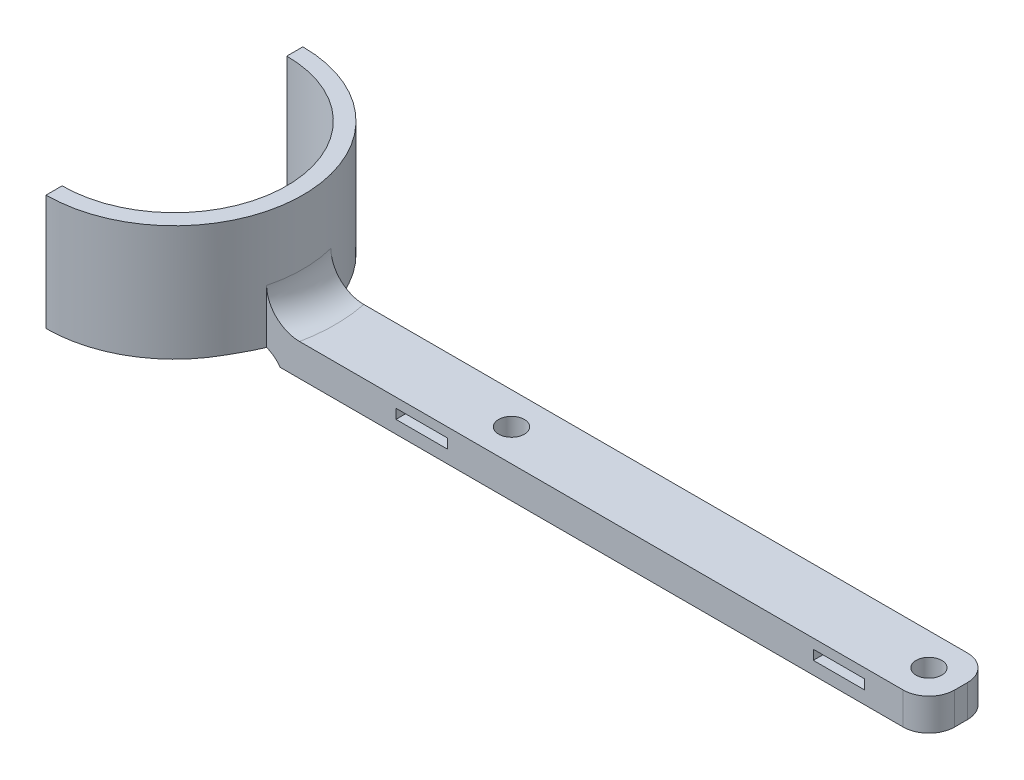
ISO-10303-21;
HEADER;
FILE_DESCRIPTION(('STEP AP214'),'2;1');
FILE_NAME('part.step','',(''),(''),'','','');
FILE_SCHEMA(('AUTOMOTIVE_DESIGN { 1 0 10303 214 1 1 1 1 }'));
ENDSEC;
DATA;
#1=APPLICATION_CONTEXT('core data for automotive mechanical design processes');
#2=APPLICATION_PROTOCOL_DEFINITION('international standard','automotive_design',2000,#1);
#3=PRODUCT_CONTEXT('',#1,'mechanical');
#4=PRODUCT('Part','Part','',(#3));
#5=PRODUCT_RELATED_PRODUCT_CATEGORY('part','',(#4));
#6=PRODUCT_DEFINITION_FORMATION('','',#4);
#7=PRODUCT_DEFINITION_CONTEXT('part definition',#1,'design');
#8=PRODUCT_DEFINITION('design','',#6,#7);
#9=PRODUCT_DEFINITION_SHAPE('','',#8);
#10=(LENGTH_UNIT() NAMED_UNIT(*) SI_UNIT(.MILLI.,.METRE.));
#11=(NAMED_UNIT(*) PLANE_ANGLE_UNIT() SI_UNIT($,.RADIAN.));
#12=(NAMED_UNIT(*) SI_UNIT($,.STERADIAN.) SOLID_ANGLE_UNIT());
#13=UNCERTAINTY_MEASURE_WITH_UNIT(LENGTH_MEASURE(1.E-05),#10,'distance_accuracy_value','');
#14=(GEOMETRIC_REPRESENTATION_CONTEXT(3) GLOBAL_UNCERTAINTY_ASSIGNED_CONTEXT((#13)) GLOBAL_UNIT_ASSIGNED_CONTEXT((#10,
#11,#12)) REPRESENTATION_CONTEXT('',''));
#15=CARTESIAN_POINT('',(0.,0.,0.));
#16=DIRECTION('',(0.,0.,1.));
#17=DIRECTION('',(1.,0.,0.));
#18=AXIS2_PLACEMENT_3D('',#15,#16,#17);
#19=CARTESIAN_POINT('',(0.,2.,0.));
#20=DIRECTION('',(0.,-1.,0.));
#21=DIRECTION('',(0.,0.,-1.));
#22=AXIS2_PLACEMENT_3D('',#19,#20,#21);
#23=PLANE('',#22);
#24=CARTESIAN_POINT('',(-17.5,2.,-5.));
#25=DIRECTION('',(0.,-1.,0.));
#26=DIRECTION('',(0.,0.,-1.));
#27=AXIS2_PLACEMENT_3D('',#24,#25,#26);
#28=CIRCLE('',#27,20.);
#29=CARTESIAN_POINT('',(0.,2.,-14.6824583655185));
#30=VERTEX_POINT('',#29);
#31=CARTESIAN_POINT('',(-17.5,2.,-25.));
#32=VERTEX_POINT('',#31);
#33=EDGE_CURVE('E323',#30,#32,#28,.F.);
#34=ORIENTED_EDGE('',*,*,#33,.F.);
#35=DIRECTION('',(0.,0.,1.));
#36=VECTOR('',#35,1.);
#37=CARTESIAN_POINT('',(0.,2.,0.));
#38=LINE('',#37,#36);
#39=CARTESIAN_POINT('',(0.,2.,-5.));
#40=VERTEX_POINT('',#39);
#41=EDGE_CURVE('E228',#30,#40,#38,.T.);
#42=ORIENTED_EDGE('',*,*,#41,.T.);
#43=CARTESIAN_POINT('',(-17.5,2.,-5.));
#44=DIRECTION('',(0.,-1.,0.));
#45=DIRECTION('',(0.,0.,-1.));
#46=AXIS2_PLACEMENT_3D('',#43,#44,#45);
#47=CIRCLE('',#46,17.5);
#48=CARTESIAN_POINT('',(-17.5,2.,-22.5));
#49=VERTEX_POINT('',#48);
#50=EDGE_CURVE('E207',#40,#49,#47,.F.);
#51=ORIENTED_EDGE('',*,*,#50,.T.);
#52=DIRECTION('',(0.,0.,-1.));
#53=VECTOR('',#52,1.);
#54=CARTESIAN_POINT('',(-17.5,2.,-38.3026296480996));
#55=LINE('',#54,#53);
#56=EDGE_CURVE('E321',#49,#32,#55,.T.);
#57=ORIENTED_EDGE('',*,*,#56,.T.);
#58=EDGE_LOOP('',(#34,#42,#51,#57));
#59=FACE_BOUND('',#58,.T.);
#60=ADVANCED_FACE('F45',(#59),#23,.T.);
#61=CARTESIAN_POINT('',(-17.5,0.,-5.));
#62=DIRECTION('',(0.,1.,0.));
#63=DIRECTION('',(0.,0.,1.));
#64=AXIS2_PLACEMENT_3D('',#61,#62,#63);
#65=CYLINDRICAL_SURFACE('',#64,20.);
#66=DIRECTION('',(0.,1.,0.));
#67=VECTOR('',#66,1.);
#68=CARTESIAN_POINT('',(1.86491673103708,0.,0.));
#69=LINE('',#68,#67);
#70=CARTESIAN_POINT('',(1.86491673103708,10.,0.));
#71=VERTEX_POINT('',#70);
#72=CARTESIAN_POINT('',(1.86491673103708,1.6391901864763,0.));
#73=VERTEX_POINT('',#72);
#74=EDGE_CURVE('E72',#71,#73,#69,.F.);
#75=ORIENTED_EDGE('',*,*,#74,.F.);
#76=CARTESIAN_POINT('',(-17.5,10.,-5.));
#77=DIRECTION('',(0.,-1.,0.));
#78=DIRECTION('',(0.,0.,-1.));
#79=AXIS2_PLACEMENT_3D('',#76,#77,#78);
#80=CIRCLE('',#79,20.);
#81=CARTESIAN_POINT('',(1.86491673103708,10.,-10.));
#82=VERTEX_POINT('',#81);
#83=EDGE_CURVE('E455',#71,#82,#80,.F.);
#84=ORIENTED_EDGE('',*,*,#83,.T.);
#85=DIRECTION('',(0.,1.,0.));
#86=VECTOR('',#85,1.);
#87=CARTESIAN_POINT('',(1.86491673103708,0.,-10.));
#88=LINE('',#87,#86);
#89=CARTESIAN_POINT('',(1.86491673103708,1.6391901864763,-10.));
#90=VERTEX_POINT('',#89);
#91=EDGE_CURVE('E64',#90,#82,#88,.T.);
#92=ORIENTED_EDGE('',*,*,#91,.F.);
#93=CARTESIAN_POINT('',(1.86491673103708,1.6391901864763,-10.));
#94=CARTESIAN_POINT('',(1.81226329074044,1.6603515909012,-10.2039176181783));
#95=CARTESIAN_POINT('',(1.75640467132598,1.68177058884214,-10.4069575920873));
#96=CARTESIAN_POINT('',(1.63829552342442,1.72439816300847,-10.8111972007738));
#97=CARTESIAN_POINT('',(1.57604484519339,1.74560673429152,-11.0123967923172));
#98=CARTESIAN_POINT('',(1.38035329785686,1.80763126287868,-11.6112052217273));
#99=CARTESIAN_POINT('',(1.23747579915219,1.84705921413643,-12.0059480297596));
#100=CARTESIAN_POINT('',(1.00450760610095,1.89870188485478,-12.5912670586032));
#101=CARTESIAN_POINT('',(0.923726300532522,1.91466848018121,-12.785275948779));
#102=CARTESIAN_POINT('',(0.755992419655626,1.94324940450123,-13.1708587526142));
#103=CARTESIAN_POINT('',(0.669040235316233,1.95586394563148,-13.3624328196318));
#104=CARTESIAN_POINT('',(0.488622628244336,1.97690087302719,-13.7438063077981));
#105=CARTESIAN_POINT('',(0.395129240854922,1.98530382628287,-13.9335936084707));
#106=CARTESIAN_POINT('',(0.202079029650203,1.99684735804117,-14.3102755909404));
#107=CARTESIAN_POINT('',(0.102520726105051,1.99998664693274,-14.4971695527531));
#108=CARTESIAN_POINT('',(0.,2.00000000000002,-14.6824583655185));
#109=B_SPLINE_CURVE_WITH_KNOTS('',3,(#93,#94,#95,#96,#97,#98,#99,#100,#101,#102,#103,#104,#105,
#106,#107,#108),.UNSPECIFIED.,.F.,.F.,(4,2,2,2,2,2,2,4),(0.,0.634927689302532,1.26987025617077,
2.53376875469085,3.16595072787684,3.79809268353263,4.43312520218716,5.06831328268851),.UNSPECIFIED.);
#110=EDGE_CURVE('E13',#90,#30,#109,.T.);
#111=ORIENTED_EDGE('',*,*,#110,.T.);
#112=ORIENTED_EDGE('',*,*,#33,.T.);
#113=DIRECTION('',(0.,1.,0.));
#114=VECTOR('',#113,1.);
#115=CARTESIAN_POINT('',(-17.5,0.,-25.));
#116=LINE('',#115,#114);
#117=CARTESIAN_POINT('',(-17.5,20.,-25.));
#118=VERTEX_POINT('',#117);
#119=EDGE_CURVE('E401',#118,#32,#116,.F.);
#120=ORIENTED_EDGE('',*,*,#119,.F.);
#121=CARTESIAN_POINT('',(-17.5,20.,-5.));
#122=DIRECTION('',(0.,1.,0.));
#123=DIRECTION('',(0.,0.,1.));
#124=AXIS2_PLACEMENT_3D('',#121,#122,#123);
#125=CIRCLE('',#124,20.);
#126=CARTESIAN_POINT('',(-17.5,20.,15.));
#127=VERTEX_POINT('',#126);
#128=EDGE_CURVE('E407',#127,#118,#125,.T.);
#129=ORIENTED_EDGE('',*,*,#128,.F.);
#130=DIRECTION('',(0.,1.,0.));
#131=VECTOR('',#130,1.);
#132=CARTESIAN_POINT('',(-17.5,0.,15.));
#133=LINE('',#132,#131);
#134=CARTESIAN_POINT('',(-17.5,2.,15.));
#135=VERTEX_POINT('',#134);
#136=EDGE_CURVE('E394',#135,#127,#133,.T.);
#137=ORIENTED_EDGE('',*,*,#136,.F.);
#138=CARTESIAN_POINT('',(0.,2.,4.68245836551854));
#139=VERTEX_POINT('',#138);
#140=EDGE_CURVE('E319',#135,#139,#28,.F.);
#141=ORIENTED_EDGE('',*,*,#140,.T.);
#142=CARTESIAN_POINT('',(0.,2.,4.68245836551854));
#143=CARTESIAN_POINT('',(0.102520726105052,1.99998664693273,4.49716955275312));
#144=CARTESIAN_POINT('',(0.202079029650203,1.99684735804117,4.31027559094042));
#145=CARTESIAN_POINT('',(0.39512924085492,1.98530382628287,3.93359360847075));
#146=CARTESIAN_POINT('',(0.488622628244331,1.97690087302719,3.7438063077981));
#147=CARTESIAN_POINT('',(0.669040235316227,1.95586394563148,3.36243281963182));
#148=CARTESIAN_POINT('',(0.75599241965562,1.94324940450123,3.17085875261421));
#149=CARTESIAN_POINT('',(0.92372630053252,1.91466848018121,2.78527594877901));
#150=CARTESIAN_POINT('',(1.00450760610095,1.89870188485478,2.59126705860322));
#151=CARTESIAN_POINT('',(1.23747579915219,1.84705921413643,2.00594802975964));
#152=CARTESIAN_POINT('',(1.38035329785685,1.80763126287869,1.61120522172731));
#153=CARTESIAN_POINT('',(1.57604484519338,1.74560673429152,1.0123967923172));
#154=CARTESIAN_POINT('',(1.63829552342441,1.72439816300846,0.811197200773822));
#155=CARTESIAN_POINT('',(1.75640467132598,1.68177058884214,0.406957592087329));
#156=CARTESIAN_POINT('',(1.81226329074045,1.66035159090122,0.203917618178342));
#157=CARTESIAN_POINT('',(1.86491673103708,1.63919018647635,0.));
#158=B_SPLINE_CURVE_WITH_KNOTS('',3,(#142,#143,#144,#145,#146,#147,#148,#149,#150,#151,#152,
#153,#154,#155,#156,#157),.UNSPECIFIED.,.F.,.F.,(4,2,2,2,2,2,2,4),(0.,0.63518808050135,
1.27022059915589,1.90236255481167,2.53454452799766,3.79844302651774,4.43338559338598,
5.06831328268851),.UNSPECIFIED.);
#159=EDGE_CURVE('E221',#139,#73,#158,.T.);
#160=ORIENTED_EDGE('',*,*,#159,.T.);
#161=EDGE_LOOP('',(#75,#84,#92,#111,#112,#120,#129,#137,#141,#160));
#162=FACE_BOUND('',#161,.T.);
#163=ADVANCED_FACE('F230',(#162),#65,.T.);
#164=CARTESIAN_POINT('',(-17.5,0.,-5.));
#165=DIRECTION('',(0.,1.,0.));
#166=DIRECTION('',(0.,0.,1.));
#167=AXIS2_PLACEMENT_3D('',#164,#165,#166);
#168=CYLINDRICAL_SURFACE('',#167,17.5);
#169=CARTESIAN_POINT('',(-17.5,2.,12.5));
#170=VERTEX_POINT('',#169);
#171=EDGE_CURVE('E312',#170,#40,#47,.F.);
#172=ORIENTED_EDGE('',*,*,#171,.F.);
#173=DIRECTION('',(0.,1.,0.));
#174=VECTOR('',#173,1.);
#175=CARTESIAN_POINT('',(-17.5,0.,12.5));
#176=LINE('',#175,#174);
#177=CARTESIAN_POINT('',(-17.5,20.,12.5));
#178=VERTEX_POINT('',#177);
#179=EDGE_CURVE('E396',#170,#178,#176,.T.);
#180=ORIENTED_EDGE('',*,*,#179,.T.);
#181=CARTESIAN_POINT('',(-17.5,20.,-5.));
#182=DIRECTION('',(0.,1.,0.));
#183=DIRECTION('',(0.,0.,1.));
#184=AXIS2_PLACEMENT_3D('',#181,#182,#183);
#185=CIRCLE('',#184,17.5);
#186=CARTESIAN_POINT('',(-17.5,20.,-22.5));
#187=VERTEX_POINT('',#186);
#188=EDGE_CURVE('E404',#178,#187,#185,.T.);
#189=ORIENTED_EDGE('',*,*,#188,.T.);
#190=DIRECTION('',(0.,1.,0.));
#191=VECTOR('',#190,1.);
#192=CARTESIAN_POINT('',(-17.5,0.,-22.5));
#193=LINE('',#192,#191);
#194=EDGE_CURVE('E398',#187,#49,#193,.F.);
#195=ORIENTED_EDGE('',*,*,#194,.T.);
#196=ORIENTED_EDGE('',*,*,#50,.F.);
#197=EDGE_LOOP('',(#172,#180,#189,#195,#196));
#198=FACE_BOUND('',#197,.T.);
#199=ADVANCED_FACE('F235',(#198),#168,.F.);
#200=CARTESIAN_POINT('',(-17.5,0.,-38.3026296480996));
#201=DIRECTION('',(1.,0.,0.));
#202=DIRECTION('',(0.,0.,-1.));
#203=AXIS2_PLACEMENT_3D('',#200,#201,#202);
#204=PLANE('',#203);
#205=ORIENTED_EDGE('',*,*,#56,.F.);
#206=ORIENTED_EDGE('',*,*,#194,.F.);
#207=DIRECTION('',(0.,0.,-1.));
#208=VECTOR('',#207,1.);
#209=CARTESIAN_POINT('',(-17.5,20.,-5.));
#210=LINE('',#209,#208);
#211=EDGE_CURVE('E450',#187,#118,#210,.T.);
#212=ORIENTED_EDGE('',*,*,#211,.T.);
#213=ORIENTED_EDGE('',*,*,#119,.T.);
#214=EDGE_LOOP('',(#205,#206,#212,#213));
#215=FACE_BOUND('',#214,.T.);
#216=ADVANCED_FACE('F480',(#215),#204,.F.);
#217=DIRECTION('',(0.,0.,-1.));
#218=VECTOR('',#217,1.);
#219=CARTESIAN_POINT('',(-17.5,2.,-38.3026296480996));
#220=LINE('',#219,#218);
#221=EDGE_CURVE('E315',#135,#170,#220,.T.);
#222=ORIENTED_EDGE('',*,*,#221,.F.);
#223=ORIENTED_EDGE('',*,*,#136,.T.);
#224=DIRECTION('',(0.,0.,-1.));
#225=VECTOR('',#224,1.);
#226=CARTESIAN_POINT('',(-17.5,20.,-38.3026296480996));
#227=LINE('',#226,#225);
#228=EDGE_CURVE('E391',#127,#178,#227,.T.);
#229=ORIENTED_EDGE('',*,*,#228,.T.);
#230=ORIENTED_EDGE('',*,*,#179,.F.);
#231=EDGE_LOOP('',(#222,#223,#229,#230));
#232=FACE_BOUND('',#231,.T.);
#233=ADVANCED_FACE('F250',(#232),#204,.F.);
#234=CARTESIAN_POINT('',(101.,5.,-6.));
#235=DIRECTION('',(0.,-1.,0.));
#236=DIRECTION('',(0.,0.,-1.));
#237=AXIS2_PLACEMENT_3D('',#234,#235,#236);
#238=PLANE('',#237);
#239=DIRECTION('',(-1.,0.,0.));
#240=VECTOR('',#239,1.);
#241=CARTESIAN_POINT('',(0.,5.,-10.));
#242=LINE('',#241,#240);
#243=CARTESIAN_POINT('',(101.,5.,-10.));
#244=VERTEX_POINT('',#243);
#245=CARTESIAN_POINT('',(6.99489742783178,5.,-10.));
#246=VERTEX_POINT('',#245);
#247=EDGE_CURVE('E430',#244,#246,#242,.T.);
#248=ORIENTED_EDGE('',*,*,#247,.T.);
#249=CARTESIAN_POINT('',(-17.5,5.,-5.));
#250=DIRECTION('',(0.,-1.,0.));
#251=DIRECTION('',(0.,0.,-1.));
#252=AXIS2_PLACEMENT_3D('',#249,#250,#251);
#253=CIRCLE('',#252,25.);
#254=CARTESIAN_POINT('',(6.99489742783178,5.,0.));
#255=VERTEX_POINT('',#254);
#256=EDGE_CURVE('E453',#246,#255,#253,.T.);
#257=ORIENTED_EDGE('',*,*,#256,.T.);
#258=DIRECTION('',(1.,0.,0.));
#259=VECTOR('',#258,1.);
#260=CARTESIAN_POINT('',(0.,5.,0.));
#261=LINE('',#260,#259);
#262=CARTESIAN_POINT('',(101.,5.,0.));
#263=VERTEX_POINT('',#262);
#264=EDGE_CURVE('E216',#255,#263,#261,.T.);
#265=ORIENTED_EDGE('',*,*,#264,.T.);
#266=CARTESIAN_POINT('',(101.,5.,-4.));
#267=DIRECTION('',(0.,1.,0.));
#268=DIRECTION('',(0.,0.,1.));
#269=AXIS2_PLACEMENT_3D('',#266,#267,#268);
#270=CIRCLE('',#269,4.);
#271=CARTESIAN_POINT('',(105.,5.,-4.00000000000003));
#272=VERTEX_POINT('',#271);
#273=EDGE_CURVE('E424',#263,#272,#270,.T.);
#274=ORIENTED_EDGE('',*,*,#273,.T.);
#275=DIRECTION('',(0.,0.,-1.));
#276=VECTOR('',#275,1.);
#277=CARTESIAN_POINT('',(105.,5.,-4.00000000000003));
#278=LINE('',#277,#276);
#279=CARTESIAN_POINT('',(105.,5.,-5.99999999999997));
#280=VERTEX_POINT('',#279);
#281=EDGE_CURVE('E426',#272,#280,#278,.T.);
#282=ORIENTED_EDGE('',*,*,#281,.T.);
#283=CARTESIAN_POINT('',(101.,5.,-6.));
#284=DIRECTION('',(0.,1.,0.));
#285=DIRECTION('',(0.,0.,-1.));
#286=AXIS2_PLACEMENT_3D('',#283,#284,#285);
#287=CIRCLE('',#286,4.);
#288=EDGE_CURVE('E428',#280,#244,#287,.T.);
#289=ORIENTED_EDGE('',*,*,#288,.T.);
#290=EDGE_LOOP('',(#248,#257,#265,#274,#282,#289));
#291=FACE_BOUND('',#290,.T.);
#292=CARTESIAN_POINT('',(35.,5.,-5.));
#293=DIRECTION('',(0.,1.,0.));
#294=DIRECTION('',(0.,0.,1.));
#295=AXIS2_PLACEMENT_3D('',#292,#293,#294);
#296=CIRCLE('',#295,2.);
#297=CARTESIAN_POINT('',(35.,5.,-3.));
#298=VERTEX_POINT('',#297);
#299=EDGE_CURVE('E418',#298,#298,#296,.T.);
#300=ORIENTED_EDGE('',*,*,#299,.F.);
#301=EDGE_LOOP('',(#300));
#302=FACE_BOUND('',#301,.T.);
#303=CARTESIAN_POINT('',(100.,5.,-5.));
#304=DIRECTION('',(0.,1.,0.));
#305=DIRECTION('',(0.,0.,1.));
#306=AXIS2_PLACEMENT_3D('',#303,#304,#305);
#307=CIRCLE('',#306,2.);
#308=CARTESIAN_POINT('',(100.,5.,-3.00000000000001));
#309=VERTEX_POINT('',#308);
#310=EDGE_CURVE('E412',#309,#309,#307,.T.);
#311=ORIENTED_EDGE('',*,*,#310,.F.);
#312=EDGE_LOOP('',(#311));
#313=FACE_BOUND('',#312,.T.);
#314=ADVANCED_FACE('F247',(#291,#302,#313),#238,.F.);
#315=CARTESIAN_POINT('',(101.,0.,-6.));
#316=DIRECTION('',(0.,-1.,0.));
#317=DIRECTION('',(0.,0.,-1.));
#318=AXIS2_PLACEMENT_3D('',#315,#316,#317);
#319=PLANE('',#318);
#320=DIRECTION('',(0.,0.,1.));
#321=VECTOR('',#320,1.);
#322=CARTESIAN_POINT('',(4.,0.,24.2480124044716));
#323=LINE('',#322,#321);
#324=CARTESIAN_POINT('',(4.,0.,-10.));
#325=VERTEX_POINT('',#324);
#326=CARTESIAN_POINT('',(4.,0.,0.));
#327=VERTEX_POINT('',#326);
#328=EDGE_CURVE('E196',#325,#327,#323,.T.);
#329=ORIENTED_EDGE('',*,*,#328,.F.);
#330=DIRECTION('',(-1.,0.,0.));
#331=VECTOR('',#330,1.);
#332=CARTESIAN_POINT('',(0.,0.,-10.));
#333=LINE('',#332,#331);
#334=CARTESIAN_POINT('',(101.,0.,-10.));
#335=VERTEX_POINT('',#334);
#336=EDGE_CURVE('E201',#335,#325,#333,.T.);
#337=ORIENTED_EDGE('',*,*,#336,.F.);
#338=CARTESIAN_POINT('',(101.,0.,-6.));
#339=DIRECTION('',(0.,1.,0.));
#340=DIRECTION('',(0.,0.,-1.));
#341=AXIS2_PLACEMENT_3D('',#338,#339,#340);
#342=CIRCLE('',#341,4.);
#343=CARTESIAN_POINT('',(105.,0.,-5.99999999999997));
#344=VERTEX_POINT('',#343);
#345=EDGE_CURVE('E217',#344,#335,#342,.T.);
#346=ORIENTED_EDGE('',*,*,#345,.F.);
#347=DIRECTION('',(0.,0.,-1.));
#348=VECTOR('',#347,1.);
#349=CARTESIAN_POINT('',(105.,0.,-4.00000000000003));
#350=LINE('',#349,#348);
#351=CARTESIAN_POINT('',(105.,0.,-4.00000000000003));
#352=VERTEX_POINT('',#351);
#353=EDGE_CURVE('E436',#352,#344,#350,.T.);
#354=ORIENTED_EDGE('',*,*,#353,.F.);
#355=CARTESIAN_POINT('',(101.,0.,-4.));
#356=DIRECTION('',(0.,1.,0.));
#357=DIRECTION('',(0.,0.,1.));
#358=AXIS2_PLACEMENT_3D('',#355,#356,#357);
#359=CIRCLE('',#358,4.);
#360=CARTESIAN_POINT('',(101.,0.,0.));
#361=VERTEX_POINT('',#360);
#362=EDGE_CURVE('E434',#361,#352,#359,.T.);
#363=ORIENTED_EDGE('',*,*,#362,.F.);
#364=DIRECTION('',(1.,0.,0.));
#365=VECTOR('',#364,1.);
#366=CARTESIAN_POINT('',(0.,0.,0.));
#367=LINE('',#366,#365);
#368=EDGE_CURVE('E203',#327,#361,#367,.T.);
#369=ORIENTED_EDGE('',*,*,#368,.F.);
#370=EDGE_LOOP('',(#329,#337,#346,#354,#363,#369));
#371=FACE_BOUND('',#370,.T.);
#372=CARTESIAN_POINT('',(35.,0.,-5.));
#373=DIRECTION('',(0.,1.,0.));
#374=DIRECTION('',(0.,0.,1.));
#375=AXIS2_PLACEMENT_3D('',#372,#373,#374);
#376=CIRCLE('',#375,2.);
#377=CARTESIAN_POINT('',(35.,0.,-3.));
#378=VERTEX_POINT('',#377);
#379=EDGE_CURVE('E415',#378,#378,#376,.T.);
#380=ORIENTED_EDGE('',*,*,#379,.T.);
#381=EDGE_LOOP('',(#380));
#382=FACE_BOUND('',#381,.T.);
#383=CARTESIAN_POINT('',(100.,0.,-5.));
#384=DIRECTION('',(0.,1.,0.));
#385=DIRECTION('',(0.,0.,1.));
#386=AXIS2_PLACEMENT_3D('',#383,#384,#385);
#387=CIRCLE('',#386,2.);
#388=CARTESIAN_POINT('',(100.,0.,-3.00000000000001));
#389=VERTEX_POINT('',#388);
#390=EDGE_CURVE('E411',#389,#389,#387,.T.);
#391=ORIENTED_EDGE('',*,*,#390,.T.);
#392=EDGE_LOOP('',(#391));
#393=FACE_BOUND('',#392,.T.);
#394=ADVANCED_FACE('F198',(#371,#382,#393),#319,.T.);
#395=CARTESIAN_POINT('',(0.,5.,0.));
#396=DIRECTION('',(0.,0.,-1.));
#397=DIRECTION('',(-1.,0.,0.));
#398=AXIS2_PLACEMENT_3D('',#395,#396,#397);
#399=PLANE('',#398);
#400=DIRECTION('',(1.,0.,0.));
#401=VECTOR('',#400,1.);
#402=CARTESIAN_POINT('',(0.,3.50000000000004,0.));
#403=LINE('',#402,#401);
#404=CARTESIAN_POINT('',(22.,3.50000000000004,0.));
#405=VERTEX_POINT('',#404);
#406=CARTESIAN_POINT('',(30.,3.50000000000004,0.));
#407=VERTEX_POINT('',#406);
#408=EDGE_CURVE('E353',#405,#407,#403,.T.);
#409=ORIENTED_EDGE('',*,*,#408,.T.);
#410=DIRECTION('',(0.,-1.,0.));
#411=VECTOR('',#410,1.);
#412=CARTESIAN_POINT('',(30.,5.,0.));
#413=LINE('',#412,#411);
#414=CARTESIAN_POINT('',(30.,2.,0.));
#415=VERTEX_POINT('',#414);
#416=EDGE_CURVE('E356',#407,#415,#413,.T.);
#417=ORIENTED_EDGE('',*,*,#416,.T.);
#418=DIRECTION('',(-1.,0.,0.));
#419=VECTOR('',#418,1.);
#420=CARTESIAN_POINT('',(0.,2.,0.));
#421=LINE('',#420,#419);
#422=CARTESIAN_POINT('',(22.,2.,0.));
#423=VERTEX_POINT('',#422);
#424=EDGE_CURVE('E341',#415,#423,#421,.T.);
#425=ORIENTED_EDGE('',*,*,#424,.T.);
#426=DIRECTION('',(0.,1.,0.));
#427=VECTOR('',#426,1.);
#428=CARTESIAN_POINT('',(22.,5.,0.));
#429=LINE('',#428,#427);
#430=EDGE_CURVE('E350',#423,#405,#429,.T.);
#431=ORIENTED_EDGE('',*,*,#430,.T.);
#432=EDGE_LOOP('',(#409,#417,#425,#431));
#433=FACE_BOUND('',#432,.T.);
#434=DIRECTION('',(1.,0.,0.));
#435=VECTOR('',#434,1.);
#436=CARTESIAN_POINT('',(0.,3.5,0.));
#437=LINE('',#436,#435);
#438=CARTESIAN_POINT('',(87.,3.5,0.));
#439=VERTEX_POINT('',#438);
#440=CARTESIAN_POINT('',(95.,3.5,0.));
#441=VERTEX_POINT('',#440);
#442=EDGE_CURVE('E385',#439,#441,#437,.T.);
#443=ORIENTED_EDGE('',*,*,#442,.T.);
#444=DIRECTION('',(0.,-1.,0.));
#445=VECTOR('',#444,1.);
#446=CARTESIAN_POINT('',(95.,5.,0.));
#447=LINE('',#446,#445);
#448=CARTESIAN_POINT('',(95.,2.,0.));
#449=VERTEX_POINT('',#448);
#450=EDGE_CURVE('E388',#441,#449,#447,.T.);
#451=ORIENTED_EDGE('',*,*,#450,.T.);
#452=DIRECTION('',(-1.,0.,0.));
#453=VECTOR('',#452,1.);
#454=CARTESIAN_POINT('',(0.,2.,0.));
#455=LINE('',#454,#453);
#456=CARTESIAN_POINT('',(87.,2.,0.));
#457=VERTEX_POINT('',#456);
#458=EDGE_CURVE('E373',#449,#457,#455,.T.);
#459=ORIENTED_EDGE('',*,*,#458,.T.);
#460=DIRECTION('',(0.,1.,0.));
#461=VECTOR('',#460,1.);
#462=CARTESIAN_POINT('',(87.,5.,0.));
#463=LINE('',#462,#461);
#464=EDGE_CURVE('E382',#457,#439,#463,.T.);
#465=ORIENTED_EDGE('',*,*,#464,.T.);
#466=EDGE_LOOP('',(#443,#451,#459,#465));
#467=FACE_BOUND('',#466,.T.);
#468=ORIENTED_EDGE('',*,*,#74,.T.);
#469=CARTESIAN_POINT('',(0.,-3.,0.));
#470=DIRECTION('',(0.,0.,-1.));
#471=DIRECTION('',(-1.,0.,0.));
#472=AXIS2_PLACEMENT_3D('',#469,#470,#471);
#473=CIRCLE('',#472,5.);
#474=EDGE_CURVE('E220',#73,#327,#473,.T.);
#475=ORIENTED_EDGE('',*,*,#474,.T.);
#476=ORIENTED_EDGE('',*,*,#368,.T.);
#477=DIRECTION('',(0.,-1.,0.));
#478=VECTOR('',#477,1.);
#479=CARTESIAN_POINT('',(101.,5.,0.));
#480=LINE('',#479,#478);
#481=EDGE_CURVE('E446',#263,#361,#480,.T.);
#482=ORIENTED_EDGE('',*,*,#481,.F.);
#483=ORIENTED_EDGE('',*,*,#264,.F.);
#484=CARTESIAN_POINT('',(6.99489742783178,5.,0.));
#485=CARTESIAN_POINT('',(6.84827256867681,4.99998623935014,0.));
#486=CARTESIAN_POINT('',(6.70165140691649,5.00619109058516,0.));
#487=CARTESIAN_POINT('',(6.40945713754822,5.03091099033612,0.));
#488=CARTESIAN_POINT('',(6.26388397940086,5.0494254411538,0.));
#489=CARTESIAN_POINT('',(5.97486426860015,5.09862862799136,0.));
#490=CARTESIAN_POINT('',(5.83141696507336,5.12931295377783,0.));
#491=CARTESIAN_POINT('',(5.54761157658349,5.20263474802971,0.));
#492=CARTESIAN_POINT('',(5.40725346667197,5.24527211992365,0.));
#493=CARTESIAN_POINT('',(5.13058194086134,5.34222714000089,0.));
#494=CARTESIAN_POINT('',(4.99426978287718,5.39654837837592,0.));
#495=CARTESIAN_POINT('',(4.72666627879046,5.51652450037217,0.));
#496=CARTESIAN_POINT('',(4.59537680449572,5.58218355996417,0.));
#497=CARTESIAN_POINT('',(4.33890462965748,5.7243484291116,0.));
#498=CARTESIAN_POINT('',(4.21371848555868,5.80084802487772,0.));
#499=CARTESIAN_POINT('',(3.97026319360027,5.96424702532644,0.));
#500=CARTESIAN_POINT('',(3.85199642926891,6.05114998263272,0.));
#501=CARTESIAN_POINT('',(3.62395626369608,6.23425532972916,0.));
#502=CARTESIAN_POINT('',(3.5141399646676,6.33040428310017,0.));
#503=CARTESIAN_POINT('',(3.30314668565956,6.5317542565203,0.));
#504=CARTESIAN_POINT('',(3.2019695015296,6.63695506254763,0.));
#505=CARTESIAN_POINT('',(3.00903207886966,6.85573381499518,0.));
#506=CARTESIAN_POINT('',(2.91727520237373,6.96931472752614,0.));
#507=CARTESIAN_POINT('',(2.74401910141099,7.20398302317907,0.));
#508=CARTESIAN_POINT('',(2.66251584806303,7.32506742991892,0.));
#509=CARTESIAN_POINT('',(2.5121063951505,7.57117164549936,0.));
#510=CARTESIAN_POINT('',(2.4429623477526,7.69604610586683,0.));
#511=CARTESIAN_POINT('',(2.31573806603581,7.95124832006536,0.));
#512=CARTESIAN_POINT('',(2.25765327961001,8.0815738031398,0.));
#513=CARTESIAN_POINT('',(2.15306231512045,8.34669598892259,0.));
#514=CARTESIAN_POINT('',(2.10654859158839,8.48148971255752,0.));
#515=CARTESIAN_POINT('',(2.02548534088789,8.75457659938317,0.));
#516=CARTESIAN_POINT('',(1.99093190999499,8.89286860492424,0.));
#517=CARTESIAN_POINT('',(1.93009988019848,9.19161115453168,0.));
#518=CARTESIAN_POINT('',(1.90566978636384,9.3524415228554,0.));
#519=CARTESIAN_POINT('',(1.87307015454859,9.67551710269234,0.));
#520=CARTESIAN_POINT('',(1.86487835614016,9.83776007064784,0.));
#521=CARTESIAN_POINT('',(1.86491673103708,10.,0.));
#522=B_SPLINE_CURVE_WITH_KNOTS('',3,(#484,#485,#486,#487,#488,#489,#490,#491,#492,#493,#494,
#495,#496,#497,#498,#499,#500,#501,#502,#503,#504,#505,#506,#507,#508,#509,#510,#511,#512,#513,
#514,#515,#516,#517,#518,#519,#520,#521),.UNSPECIFIED.,.F.,.F.,(4,2,2,2,2,2,2,2,2,2,2,2,2,2,2,2,
2,2,4),(0.,0.439738191525465,0.879455032920368,1.31901267098788,1.75856675786807,
2.19825610337059,2.6381077429907,3.07770827212663,3.51745935012646,3.95480634938013,
4.39214301085202,4.82963521570538,5.26695497946584,5.69464593110612,6.12216045831283,
6.54939546898583,6.97649090248015,7.46368339888763,7.95020755949211),.UNSPECIFIED.);
#523=EDGE_CURVE('E268',#255,#71,#522,.T.);
#524=ORIENTED_EDGE('',*,*,#523,.T.);
#525=EDGE_LOOP('',(#468,#475,#476,#482,#483,#524));
#526=FACE_BOUND('',#525,.T.);
#527=ADVANCED_FACE('F254',(#433,#467,#526),#399,.F.);
#528=CARTESIAN_POINT('',(101.,5.,-4.));
#529=DIRECTION('',(0.,-1.,0.));
#530=DIRECTION('',(0.,0.,-1.));
#531=AXIS2_PLACEMENT_3D('',#528,#529,#530);
#532=CYLINDRICAL_SURFACE('',#531,4.);
#533=ORIENTED_EDGE('',*,*,#362,.T.);
#534=DIRECTION('',(0.,-1.,0.));
#535=VECTOR('',#534,1.);
#536=CARTESIAN_POINT('',(105.,5.,-4.00000000000003));
#537=LINE('',#536,#535);
#538=EDGE_CURVE('E443',#272,#352,#537,.T.);
#539=ORIENTED_EDGE('',*,*,#538,.F.);
#540=ORIENTED_EDGE('',*,*,#273,.F.);
#541=ORIENTED_EDGE('',*,*,#481,.T.);
#542=EDGE_LOOP('',(#533,#539,#540,#541));
#543=FACE_BOUND('',#542,.T.);
#544=ADVANCED_FACE('F283',(#543),#532,.T.);
#545=CARTESIAN_POINT('',(105.,5.,-4.00000000000003));
#546=DIRECTION('',(-1.,0.,0.));
#547=DIRECTION('',(0.,0.,1.));
#548=AXIS2_PLACEMENT_3D('',#545,#546,#547);
#549=PLANE('',#548);
#550=ORIENTED_EDGE('',*,*,#353,.T.);
#551=DIRECTION('',(0.,-1.,0.));
#552=VECTOR('',#551,1.);
#553=CARTESIAN_POINT('',(105.,5.,-5.99999999999997));
#554=LINE('',#553,#552);
#555=EDGE_CURVE('E440',#280,#344,#554,.T.);
#556=ORIENTED_EDGE('',*,*,#555,.F.);
#557=ORIENTED_EDGE('',*,*,#281,.F.);
#558=ORIENTED_EDGE('',*,*,#538,.T.);
#559=EDGE_LOOP('',(#550,#556,#557,#558));
#560=FACE_BOUND('',#559,.T.);
#561=ADVANCED_FACE('F286',(#560),#549,.F.);
#562=CARTESIAN_POINT('',(101.,5.,-6.));
#563=DIRECTION('',(0.,-1.,0.));
#564=DIRECTION('',(0.,0.,-1.));
#565=AXIS2_PLACEMENT_3D('',#562,#563,#564);
#566=CYLINDRICAL_SURFACE('',#565,4.);
#567=ORIENTED_EDGE('',*,*,#345,.T.);
#568=DIRECTION('',(0.,-1.,0.));
#569=VECTOR('',#568,1.);
#570=CARTESIAN_POINT('',(101.,5.,-10.));
#571=LINE('',#570,#569);
#572=EDGE_CURVE('E215',#244,#335,#571,.T.);
#573=ORIENTED_EDGE('',*,*,#572,.F.);
#574=ORIENTED_EDGE('',*,*,#288,.F.);
#575=ORIENTED_EDGE('',*,*,#555,.T.);
#576=EDGE_LOOP('',(#567,#573,#574,#575));
#577=FACE_BOUND('',#576,.T.);
#578=ADVANCED_FACE('F258',(#577),#566,.T.);
#579=CARTESIAN_POINT('',(0.,5.,-10.));
#580=DIRECTION('',(0.,0.,1.));
#581=DIRECTION('',(1.,0.,0.));
#582=AXIS2_PLACEMENT_3D('',#579,#580,#581);
#583=PLANE('',#582);
#584=DIRECTION('',(-1.,0.,0.));
#585=VECTOR('',#584,1.);
#586=CARTESIAN_POINT('',(30.,2.,-10.));
#587=LINE('',#586,#585);
#588=CARTESIAN_POINT('',(30.,2.,-10.));
#589=VERTEX_POINT('',#588);
#590=CARTESIAN_POINT('',(22.,2.,-10.));
#591=VERTEX_POINT('',#590);
#592=EDGE_CURVE('E329',#589,#591,#587,.T.);
#593=ORIENTED_EDGE('',*,*,#592,.F.);
#594=DIRECTION('',(0.,-1.,0.));
#595=VECTOR('',#594,1.);
#596=CARTESIAN_POINT('',(30.,3.50000000000004,-10.));
#597=LINE('',#596,#595);
#598=CARTESIAN_POINT('',(30.,3.50000000000004,-10.));
#599=VERTEX_POINT('',#598);
#600=EDGE_CURVE('E327',#599,#589,#597,.T.);
#601=ORIENTED_EDGE('',*,*,#600,.F.);
#602=DIRECTION('',(1.,0.,0.));
#603=VECTOR('',#602,1.);
#604=CARTESIAN_POINT('',(30.,3.50000000000004,-10.));
#605=LINE('',#604,#603);
#606=CARTESIAN_POINT('',(22.,3.50000000000004,-10.));
#607=VERTEX_POINT('',#606);
#608=EDGE_CURVE('E335',#607,#599,#605,.T.);
#609=ORIENTED_EDGE('',*,*,#608,.F.);
#610=DIRECTION('',(0.,1.,0.));
#611=VECTOR('',#610,1.);
#612=CARTESIAN_POINT('',(22.,3.50000000000004,-10.));
#613=LINE('',#612,#611);
#614=EDGE_CURVE('E332',#591,#607,#613,.T.);
#615=ORIENTED_EDGE('',*,*,#614,.F.);
#616=EDGE_LOOP('',(#593,#601,#609,#615));
#617=FACE_BOUND('',#616,.T.);
#618=DIRECTION('',(-1.,0.,0.));
#619=VECTOR('',#618,1.);
#620=CARTESIAN_POINT('',(95.,2.,-10.));
#621=LINE('',#620,#619);
#622=CARTESIAN_POINT('',(95.,2.,-10.));
#623=VERTEX_POINT('',#622);
#624=CARTESIAN_POINT('',(87.,2.,-10.));
#625=VERTEX_POINT('',#624);
#626=EDGE_CURVE('E361',#623,#625,#621,.T.);
#627=ORIENTED_EDGE('',*,*,#626,.F.);
#628=DIRECTION('',(0.,-1.,0.));
#629=VECTOR('',#628,1.);
#630=CARTESIAN_POINT('',(95.,3.5,-10.));
#631=LINE('',#630,#629);
#632=CARTESIAN_POINT('',(95.,3.5,-10.));
#633=VERTEX_POINT('',#632);
#634=EDGE_CURVE('E359',#633,#623,#631,.T.);
#635=ORIENTED_EDGE('',*,*,#634,.F.);
#636=DIRECTION('',(1.,0.,0.));
#637=VECTOR('',#636,1.);
#638=CARTESIAN_POINT('',(95.,3.5,-10.));
#639=LINE('',#638,#637);
#640=CARTESIAN_POINT('',(87.,3.5,-10.));
#641=VERTEX_POINT('',#640);
#642=EDGE_CURVE('E367',#641,#633,#639,.T.);
#643=ORIENTED_EDGE('',*,*,#642,.F.);
#644=DIRECTION('',(0.,1.,0.));
#645=VECTOR('',#644,1.);
#646=CARTESIAN_POINT('',(87.,3.5,-10.));
#647=LINE('',#646,#645);
#648=EDGE_CURVE('E364',#625,#641,#647,.T.);
#649=ORIENTED_EDGE('',*,*,#648,.F.);
#650=EDGE_LOOP('',(#627,#635,#643,#649));
#651=FACE_BOUND('',#650,.T.);
#652=ORIENTED_EDGE('',*,*,#336,.T.);
#653=CARTESIAN_POINT('',(0.,-3.,-10.));
#654=DIRECTION('',(0.,0.,1.));
#655=DIRECTION('',(1.,0.,0.));
#656=AXIS2_PLACEMENT_3D('',#653,#654,#655);
#657=CIRCLE('',#656,5.);
#658=EDGE_CURVE('E58',#325,#90,#657,.T.);
#659=ORIENTED_EDGE('',*,*,#658,.T.);
#660=ORIENTED_EDGE('',*,*,#91,.T.);
#661=CARTESIAN_POINT('',(1.86491673103708,10.,-10.));
#662=CARTESIAN_POINT('',(1.86489808278,9.86237333544804,-10.));
#663=CARTESIAN_POINT('',(1.87078461128807,9.72475091274214,-10.));
#664=CARTESIAN_POINT('',(1.89423194438067,9.45052097199509,-10.));
#665=CARTESIAN_POINT('',(1.91179127607382,9.31391332810644,-10.));
#666=CARTESIAN_POINT('',(1.95840752093667,9.04292062848671,-10.));
#667=CARTESIAN_POINT('',(1.98744433104574,8.90853211238053,-10.));
#668=CARTESIAN_POINT('',(2.05675636329064,8.64268634509948,-10.));
#669=CARTESIAN_POINT('',(2.09703162436861,8.51122910408341,-10.));
#670=CARTESIAN_POINT('',(2.18847230717807,8.25217621899574,-10.));
#671=CARTESIAN_POINT('',(2.23963656275552,8.12458016308153,-10.));
#672=CARTESIAN_POINT('',(2.3524516467423,7.87405696630322,-10.));
#673=CARTESIAN_POINT('',(2.41410634760383,7.75113157014329,-10.));
#674=CARTESIAN_POINT('',(2.54737260147795,7.51084765295241,-10.));
#675=CARTESIAN_POINT('',(2.61898148011389,7.39348764799534,-10.));
#676=CARTESIAN_POINT('',(2.77163633988652,7.16501460284047,-10.));
#677=CARTESIAN_POINT('',(2.85268585114073,7.05390392261838,-10.));
#678=CARTESIAN_POINT('',(3.02488905876839,6.83703753536162,-10.));
#679=CARTESIAN_POINT('',(3.11617764642605,6.73138893305287,-10.));
#680=CARTESIAN_POINT('',(3.30717300535191,6.52793050351375,-10.));
#681=CARTESIAN_POINT('',(3.40688287517282,6.43012358760667,-10.));
#682=CARTESIAN_POINT('',(3.61396319430983,6.24300326127382,-10.));
#683=CARTESIAN_POINT('',(3.7213326671085,6.1536887715295,-10.));
#684=CARTESIAN_POINT('',(3.94298372185358,5.98406843441632,-10.));
#685=CARTESIAN_POINT('',(4.05726780329284,5.90376587498813,-10.));
#686=CARTESIAN_POINT('',(4.4159635892433,5.67288183393806,-10.));
#687=CARTESIAN_POINT('',(4.6704406662506,5.53755112876395,-10.));
#688=CARTESIAN_POINT('',(5.19803867654763,5.31073869844372,-10.));
#689=CARTESIAN_POINT('',(5.47115340726935,5.2192424658061,-10.));
#690=CARTESIAN_POINT('',(5.95345640203982,5.1007445109237,-10.));
#691=CARTESIAN_POINT('',(6.16006724211789,5.06301254212713,-10.));
#692=CARTESIAN_POINT('',(6.57606104565099,5.01263508337683,-10.));
#693=CARTESIAN_POINT('',(6.78544022589839,4.99995833057963,-10.));
#694=CARTESIAN_POINT('',(6.99489742783178,5.,-10.));
#695=B_SPLINE_CURVE_WITH_KNOTS('',3,(#661,#662,#663,#664,#665,#666,#667,#668,#669,#670,#671,
#672,#673,#674,#675,#676,#677,#678,#679,#680,#681,#682,#683,#684,#685,#686,#687,#688,#689,#690,
#691,#692,#693,#694),.UNSPECIFIED.,.F.,.F.,(4,2,2,2,2,2,2,2,2,2,2,2,2,2,2,2,4),(0.,
0.412747790058947,0.825443508881344,1.23741956237656,1.6493970434199,2.06133042602332,
2.47341620129493,2.88539147520933,3.29752129579023,3.71591728865574,4.13446790376807,
4.55296525318861,4.97161479548013,5.83200834293627,6.69211693681444,7.32074458084533,
7.94858735334463),.UNSPECIFIED.);
#696=EDGE_CURVE('E262',#82,#246,#695,.T.);
#697=ORIENTED_EDGE('',*,*,#696,.T.);
#698=ORIENTED_EDGE('',*,*,#247,.F.);
#699=ORIENTED_EDGE('',*,*,#572,.T.);
#700=EDGE_LOOP('',(#652,#659,#660,#697,#698,#699));
#701=FACE_BOUND('',#700,.T.);
#702=ADVANCED_FACE('F211',(#617,#651,#701),#583,.F.);
#703=CARTESIAN_POINT('',(35.,5.,-5.));
#704=DIRECTION('',(0.,-1.,0.));
#705=DIRECTION('',(0.,0.,-1.));
#706=AXIS2_PLACEMENT_3D('',#703,#704,#705);
#707=CYLINDRICAL_SURFACE('',#706,2.);
#708=ORIENTED_EDGE('',*,*,#299,.T.);
#709=EDGE_LOOP('',(#708));
#710=FACE_BOUND('',#709,.T.);
#711=ORIENTED_EDGE('',*,*,#379,.F.);
#712=EDGE_LOOP('',(#711));
#713=FACE_BOUND('',#712,.T.);
#714=ADVANCED_FACE('F242',(#710,#713),#707,.F.);
#715=CARTESIAN_POINT('',(100.,5.,-5.));
#716=DIRECTION('',(0.,-1.,0.));
#717=DIRECTION('',(0.,0.,-1.));
#718=AXIS2_PLACEMENT_3D('',#715,#716,#717);
#719=CYLINDRICAL_SURFACE('',#718,2.);
#720=ORIENTED_EDGE('',*,*,#310,.T.);
#721=EDGE_LOOP('',(#720));
#722=FACE_BOUND('',#721,.T.);
#723=ORIENTED_EDGE('',*,*,#390,.F.);
#724=EDGE_LOOP('',(#723));
#725=FACE_BOUND('',#724,.T.);
#726=ADVANCED_FACE('F237',(#722,#725),#719,.F.);
#727=CARTESIAN_POINT('',(-17.5,20.,-5.));
#728=DIRECTION('',(0.,1.,0.));
#729=DIRECTION('',(0.,0.,1.));
#730=AXIS2_PLACEMENT_3D('',#727,#728,#729);
#731=PLANE('',#730);
#732=ORIENTED_EDGE('',*,*,#228,.F.);
#733=ORIENTED_EDGE('',*,*,#128,.T.);
#734=ORIENTED_EDGE('',*,*,#211,.F.);
#735=ORIENTED_EDGE('',*,*,#188,.F.);
#736=EDGE_LOOP('',(#732,#733,#734,#735));
#737=FACE_BOUND('',#736,.T.);
#738=ADVANCED_FACE('F241',(#737),#731,.T.);
#739=CARTESIAN_POINT('',(95.,3.5,10.));
#740=DIRECTION('',(1.,0.,0.));
#741=DIRECTION('',(0.,0.,-1.));
#742=AXIS2_PLACEMENT_3D('',#739,#740,#741);
#743=PLANE('',#742);
#744=DIRECTION('',(0.,0.,-1.));
#745=VECTOR('',#744,1.);
#746=CARTESIAN_POINT('',(95.,3.5,10.));
#747=LINE('',#746,#745);
#748=EDGE_CURVE('E371',#441,#633,#747,.T.);
#749=ORIENTED_EDGE('',*,*,#748,.T.);
#750=ORIENTED_EDGE('',*,*,#634,.T.);
#751=DIRECTION('',(0.,0.,-1.));
#752=VECTOR('',#751,1.);
#753=CARTESIAN_POINT('',(95.,2.,10.));
#754=LINE('',#753,#752);
#755=EDGE_CURVE('E370',#449,#623,#754,.T.);
#756=ORIENTED_EDGE('',*,*,#755,.F.);
#757=ORIENTED_EDGE('',*,*,#450,.F.);
#758=EDGE_LOOP('',(#749,#750,#756,#757));
#759=FACE_BOUND('',#758,.T.);
#760=ADVANCED_FACE('F488',(#759),#743,.F.);
#761=CARTESIAN_POINT('',(95.,3.5,10.));
#762=DIRECTION('',(0.,1.,0.));
#763=DIRECTION('',(0.,0.,1.));
#764=AXIS2_PLACEMENT_3D('',#761,#762,#763);
#765=PLANE('',#764);
#766=DIRECTION('',(0.,0.,-1.));
#767=VECTOR('',#766,1.);
#768=CARTESIAN_POINT('',(87.,3.5,10.));
#769=LINE('',#768,#767);
#770=EDGE_CURVE('E374',#439,#641,#769,.T.);
#771=ORIENTED_EDGE('',*,*,#770,.T.);
#772=ORIENTED_EDGE('',*,*,#642,.T.);
#773=ORIENTED_EDGE('',*,*,#748,.F.);
#774=ORIENTED_EDGE('',*,*,#442,.F.);
#775=EDGE_LOOP('',(#771,#772,#773,#774));
#776=FACE_BOUND('',#775,.T.);
#777=ADVANCED_FACE('F494',(#776),#765,.F.);
#778=CARTESIAN_POINT('',(87.,3.5,10.));
#779=DIRECTION('',(-1.,0.,0.));
#780=DIRECTION('',(0.,0.,1.));
#781=AXIS2_PLACEMENT_3D('',#778,#779,#780);
#782=PLANE('',#781);
#783=DIRECTION('',(0.,0.,-1.));
#784=VECTOR('',#783,1.);
#785=CARTESIAN_POINT('',(87.,2.,10.));
#786=LINE('',#785,#784);
#787=EDGE_CURVE('E376',#457,#625,#786,.T.);
#788=ORIENTED_EDGE('',*,*,#787,.T.);
#789=ORIENTED_EDGE('',*,*,#648,.T.);
#790=ORIENTED_EDGE('',*,*,#770,.F.);
#791=ORIENTED_EDGE('',*,*,#464,.F.);
#792=EDGE_LOOP('',(#788,#789,#790,#791));
#793=FACE_BOUND('',#792,.T.);
#794=ADVANCED_FACE('F499',(#793),#782,.F.);
#795=CARTESIAN_POINT('',(95.,2.,10.));
#796=DIRECTION('',(0.,-1.,0.));
#797=DIRECTION('',(0.,0.,-1.));
#798=AXIS2_PLACEMENT_3D('',#795,#796,#797);
#799=PLANE('',#798);
#800=ORIENTED_EDGE('',*,*,#755,.T.);
#801=ORIENTED_EDGE('',*,*,#626,.T.);
#802=ORIENTED_EDGE('',*,*,#787,.F.);
#803=ORIENTED_EDGE('',*,*,#458,.F.);
#804=EDGE_LOOP('',(#800,#801,#802,#803));
#805=FACE_BOUND('',#804,.T.);
#806=ADVANCED_FACE('F511',(#805),#799,.F.);
#807=CARTESIAN_POINT('',(30.,3.50000000000004,10.));
#808=DIRECTION('',(1.,0.,0.));
#809=DIRECTION('',(0.,0.,-1.));
#810=AXIS2_PLACEMENT_3D('',#807,#808,#809);
#811=PLANE('',#810);
#812=DIRECTION('',(0.,0.,-1.));
#813=VECTOR('',#812,1.);
#814=CARTESIAN_POINT('',(30.,3.50000000000004,10.));
#815=LINE('',#814,#813);
#816=EDGE_CURVE('E339',#407,#599,#815,.T.);
#817=ORIENTED_EDGE('',*,*,#816,.T.);
#818=ORIENTED_EDGE('',*,*,#600,.T.);
#819=DIRECTION('',(0.,0.,-1.));
#820=VECTOR('',#819,1.);
#821=CARTESIAN_POINT('',(30.,2.,10.));
#822=LINE('',#821,#820);
#823=EDGE_CURVE('E338',#415,#589,#822,.T.);
#824=ORIENTED_EDGE('',*,*,#823,.F.);
#825=ORIENTED_EDGE('',*,*,#416,.F.);
#826=EDGE_LOOP('',(#817,#818,#824,#825));
#827=FACE_BOUND('',#826,.T.);
#828=ADVANCED_FACE('F520',(#827),#811,.F.);
#829=CARTESIAN_POINT('',(30.,3.50000000000004,10.));
#830=DIRECTION('',(0.,1.,0.));
#831=DIRECTION('',(0.,0.,1.));
#832=AXIS2_PLACEMENT_3D('',#829,#830,#831);
#833=PLANE('',#832);
#834=DIRECTION('',(0.,0.,-1.));
#835=VECTOR('',#834,1.);
#836=CARTESIAN_POINT('',(22.,3.50000000000004,10.));
#837=LINE('',#836,#835);
#838=EDGE_CURVE('E342',#405,#607,#837,.T.);
#839=ORIENTED_EDGE('',*,*,#838,.T.);
#840=ORIENTED_EDGE('',*,*,#608,.T.);
#841=ORIENTED_EDGE('',*,*,#816,.F.);
#842=ORIENTED_EDGE('',*,*,#408,.F.);
#843=EDGE_LOOP('',(#839,#840,#841,#842));
#844=FACE_BOUND('',#843,.T.);
#845=ADVANCED_FACE('F523',(#844),#833,.F.);
#846=CARTESIAN_POINT('',(22.,3.50000000000004,10.));
#847=DIRECTION('',(-1.,0.,0.));
#848=DIRECTION('',(0.,0.,1.));
#849=AXIS2_PLACEMENT_3D('',#846,#847,#848);
#850=PLANE('',#849);
#851=DIRECTION('',(0.,0.,-1.));
#852=VECTOR('',#851,1.);
#853=CARTESIAN_POINT('',(22.,2.,10.));
#854=LINE('',#853,#852);
#855=EDGE_CURVE('E344',#423,#591,#854,.T.);
#856=ORIENTED_EDGE('',*,*,#855,.T.);
#857=ORIENTED_EDGE('',*,*,#614,.T.);
#858=ORIENTED_EDGE('',*,*,#838,.F.);
#859=ORIENTED_EDGE('',*,*,#430,.F.);
#860=EDGE_LOOP('',(#856,#857,#858,#859));
#861=FACE_BOUND('',#860,.T.);
#862=ADVANCED_FACE('F307',(#861),#850,.F.);
#863=CARTESIAN_POINT('',(30.,2.,10.));
#864=DIRECTION('',(0.,-1.,0.));
#865=DIRECTION('',(0.,0.,-1.));
#866=AXIS2_PLACEMENT_3D('',#863,#864,#865);
#867=PLANE('',#866);
#868=ORIENTED_EDGE('',*,*,#823,.T.);
#869=ORIENTED_EDGE('',*,*,#592,.T.);
#870=ORIENTED_EDGE('',*,*,#855,.F.);
#871=ORIENTED_EDGE('',*,*,#424,.F.);
#872=EDGE_LOOP('',(#868,#869,#870,#871));
#873=FACE_BOUND('',#872,.T.);
#874=ADVANCED_FACE('F302',(#873),#867,.F.);
#875=ORIENTED_EDGE('',*,*,#171,.T.);
#876=DIRECTION('',(0.,0.,1.));
#877=VECTOR('',#876,1.);
#878=CARTESIAN_POINT('',(0.,2.,0.));
#879=LINE('',#878,#877);
#880=EDGE_CURVE('E267',#40,#139,#879,.T.);
#881=ORIENTED_EDGE('',*,*,#880,.T.);
#882=ORIENTED_EDGE('',*,*,#140,.F.);
#883=ORIENTED_EDGE('',*,*,#221,.T.);
#884=EDGE_LOOP('',(#875,#881,#882,#883));
#885=FACE_BOUND('',#884,.T.);
#886=ADVANCED_FACE('F277',(#885),#23,.T.);
#887=CARTESIAN_POINT('',(-17.5,10.,-5.));
#888=DIRECTION('',(0.,-1.,0.));
#889=DIRECTION('',(0.,0.,-1.));
#890=AXIS2_PLACEMENT_3D('',#887,#888,#889);
#891=TOROIDAL_SURFACE('',#890,25.,5.);
#892=ORIENTED_EDGE('',*,*,#696,.F.);
#893=ORIENTED_EDGE('',*,*,#83,.F.);
#894=ORIENTED_EDGE('',*,*,#523,.F.);
#895=ORIENTED_EDGE('',*,*,#256,.F.);
#896=EDGE_LOOP('',(#892,#893,#894,#895));
#897=FACE_BOUND('',#896,.T.);
#898=ADVANCED_FACE('F274',(#897),#891,.F.);
#899=CARTESIAN_POINT('',(0.,-3.,24.2480124044716));
#900=DIRECTION('',(0.,0.,-1.));
#901=DIRECTION('',(-1.,0.,0.));
#902=AXIS2_PLACEMENT_3D('',#899,#900,#901);
#903=CYLINDRICAL_SURFACE('',#902,5.);
#904=ORIENTED_EDGE('',*,*,#658,.F.);
#905=ORIENTED_EDGE('',*,*,#328,.T.);
#906=ORIENTED_EDGE('',*,*,#474,.F.);
#907=ORIENTED_EDGE('',*,*,#159,.F.);
#908=ORIENTED_EDGE('',*,*,#880,.F.);
#909=ORIENTED_EDGE('',*,*,#41,.F.);
#910=ORIENTED_EDGE('',*,*,#110,.F.);
#911=EDGE_LOOP('',(#904,#905,#906,#907,#908,#909,#910));
#912=FACE_BOUND('',#911,.T.);
#913=ADVANCED_FACE('F47',(#912),#903,.F.);
#914=CLOSED_SHELL('',(#60,#163,#199,#216,#233,#314,#394,#527,#544,#561,#578,#702,#714,#726,#738,
#760,#777,#794,#806,#828,#845,#862,#874,#886,#898,#913));
#915=MANIFOLD_SOLID_BREP('B2',#914);
#916=ADVANCED_BREP_SHAPE_REPRESENTATION('',(#18,#915),#14);
#917=SHAPE_DEFINITION_REPRESENTATION(#9,#916);
ENDSEC;
END-ISO-10303-21;
